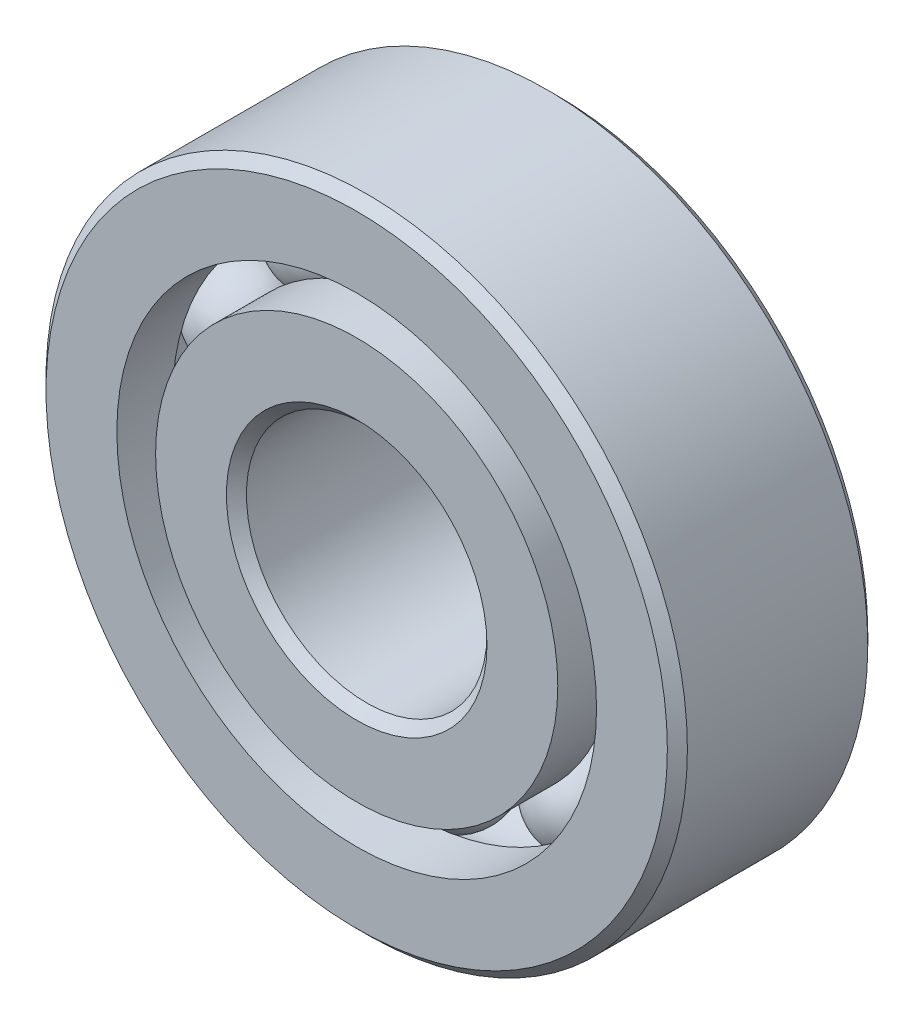
ISO-10303-21;
HEADER;
FILE_DESCRIPTION(('STEP AP214'),'2;1');
FILE_NAME('part.step','',(''),(''),'','','');
FILE_SCHEMA(('AUTOMOTIVE_DESIGN { 1 0 10303 214 1 1 1 1 }'));
ENDSEC;
DATA;
#1=APPLICATION_CONTEXT('core data for automotive mechanical design processes');
#2=APPLICATION_PROTOCOL_DEFINITION('international standard','automotive_design',2000,#1);
#3=PRODUCT_CONTEXT('',#1,'mechanical');
#4=PRODUCT('Part','Part','',(#3));
#5=PRODUCT_RELATED_PRODUCT_CATEGORY('part','',(#4));
#6=PRODUCT_DEFINITION_FORMATION('','',#4);
#7=PRODUCT_DEFINITION_CONTEXT('part definition',#1,'design');
#8=PRODUCT_DEFINITION('design','',#6,#7);
#9=PRODUCT_DEFINITION_SHAPE('','',#8);
#10=(LENGTH_UNIT() NAMED_UNIT(*) SI_UNIT(.MILLI.,.METRE.));
#11=(NAMED_UNIT(*) PLANE_ANGLE_UNIT() SI_UNIT($,.RADIAN.));
#12=(NAMED_UNIT(*) SI_UNIT($,.STERADIAN.) SOLID_ANGLE_UNIT());
#13=UNCERTAINTY_MEASURE_WITH_UNIT(LENGTH_MEASURE(1.E-05),#10,'distance_accuracy_value','');
#14=(GEOMETRIC_REPRESENTATION_CONTEXT(3) GLOBAL_UNCERTAINTY_ASSIGNED_CONTEXT((#13)) GLOBAL_UNIT_ASSIGNED_CONTEXT((#10,
#11,#12)) REPRESENTATION_CONTEXT('',''));
#15=CARTESIAN_POINT('',(0.,0.,0.));
#16=DIRECTION('',(0.,0.,1.));
#17=DIRECTION('',(1.,0.,0.));
#18=AXIS2_PLACEMENT_3D('',#15,#16,#17);
#19=CARTESIAN_POINT('',(-2.56604999203928,3.53186481606816,0.));
#20=DIRECTION('',(0.,0.,1.));
#21=DIRECTION('',(-0.587785252292462,0.809016994374955,0.));
#22=AXIS2_PLACEMENT_3D('',#19,#20,#21);
#23=SPHERICAL_SURFACE('',#22,0.961832467237323);
#24=CARTESIAN_POINT('',(-2.56604999203928,3.53186481606816,0.961832467237321));
#25=VERTEX_POINT('',#24);
#26=VERTEX_LOOP('',#25);
#27=FACE_BOUND('',#26,.T.);
#28=ADVANCED_FACE('F37',(#27),#23,.T.);
#29=CLOSED_SHELL('',(#28));
#30=MANIFOLD_SOLID_BREP('B2',#29);
#31=CARTESIAN_POINT('',(-4.15195610395102,1.34905231606818,0.));
#32=DIRECTION('',(0.,0.,1.));
#33=DIRECTION('',(-0.95105651629515,0.309016994374958,0.));
#34=AXIS2_PLACEMENT_3D('',#31,#32,#33);
#35=SPHERICAL_SURFACE('',#34,0.961832467237323);
#36=CARTESIAN_POINT('',(-4.15195610395102,1.34905231606818,0.961832467237321));
#37=VERTEX_POINT('',#36);
#38=VERTEX_LOOP('',#37);
#39=FACE_BOUND('',#38,.T.);
#40=ADVANCED_FACE('F57',(#39),#35,.T.);
#41=CLOSED_SHELL('',(#40));
#42=MANIFOLD_SOLID_BREP('B6',#41);
#43=CARTESIAN_POINT('',(-4.15195610395104,-1.34905231606809,0.));
#44=DIRECTION('',(0.,0.,1.));
#45=DIRECTION('',(-0.951056516295157,-0.309016994374938,0.));
#46=AXIS2_PLACEMENT_3D('',#43,#44,#45);
#47=SPHERICAL_SURFACE('',#46,0.961832467237323);
#48=CARTESIAN_POINT('',(-4.15195610395104,-1.34905231606809,0.961832467237321));
#49=VERTEX_POINT('',#48);
#50=VERTEX_LOOP('',#49);
#51=FACE_BOUND('',#50,.T.);
#52=ADVANCED_FACE('F77',(#51),#47,.T.);
#53=CLOSED_SHELL('',(#52));
#54=MANIFOLD_SOLID_BREP('B33',#53);
#55=CARTESIAN_POINT('',(-2.56604999203936,-3.53186481606811,0.));
#56=DIRECTION('',(0.,0.,1.));
#57=DIRECTION('',(-0.58778525229248,-0.809016994374942,0.));
#58=AXIS2_PLACEMENT_3D('',#55,#56,#57);
#59=SPHERICAL_SURFACE('',#58,0.961832467237323);
#60=CARTESIAN_POINT('',(-2.56604999203936,-3.53186481606811,0.961832467237321));
#61=VERTEX_POINT('',#60);
#62=VERTEX_LOOP('',#61);
#63=FACE_BOUND('',#62,.T.);
#64=ADVANCED_FACE('F97',(#63),#59,.T.);
#65=CLOSED_SHELL('',(#64));
#66=MANIFOLD_SOLID_BREP('B53',#65);
#67=CARTESIAN_POINT('',(0.,-4.365625,0.));
#68=DIRECTION('',(0.,0.,1.));
#69=DIRECTION('',(0.,-1.,0.));
#70=AXIS2_PLACEMENT_3D('',#67,#68,#69);
#71=SPHERICAL_SURFACE('',#70,0.961832467237323);
#72=CARTESIAN_POINT('',(0.,-4.365625,0.961832467237321));
#73=VERTEX_POINT('',#72);
#74=VERTEX_LOOP('',#73);
#75=FACE_BOUND('',#74,.T.);
#76=ADVANCED_FACE('F117',(#75),#71,.T.);
#77=CLOSED_SHELL('',(#76));
#78=MANIFOLD_SOLID_BREP('B73',#77);
#79=CARTESIAN_POINT('',(2.56604999203931,-3.53186481606815,0.));
#80=DIRECTION('',(0.,0.,1.));
#81=DIRECTION('',(0.587785252292469,-0.809016994374951,0.));
#82=AXIS2_PLACEMENT_3D('',#79,#80,#81);
#83=SPHERICAL_SURFACE('',#82,0.961832467237323);
#84=CARTESIAN_POINT('',(2.56604999203931,-3.53186481606815,0.961832467237321));
#85=VERTEX_POINT('',#84);
#86=VERTEX_LOOP('',#85);
#87=FACE_BOUND('',#86,.T.);
#88=ADVANCED_FACE('F137',(#87),#83,.T.);
#89=CLOSED_SHELL('',(#88));
#90=MANIFOLD_SOLID_BREP('B93',#89);
#91=CARTESIAN_POINT('',(4.15195610395103,-1.34905231606815,0.));
#92=DIRECTION('',(0.,0.,1.));
#93=DIRECTION('',(0.951056516295152,-0.309016994374952,0.));
#94=AXIS2_PLACEMENT_3D('',#91,#92,#93);
#95=SPHERICAL_SURFACE('',#94,0.961832467237323);
#96=CARTESIAN_POINT('',(4.15195610395103,-1.34905231606815,0.961832467237321));
#97=VERTEX_POINT('',#96);
#98=VERTEX_LOOP('',#97);
#99=FACE_BOUND('',#98,.T.);
#100=ADVANCED_FACE('F157',(#99),#95,.T.);
#101=CLOSED_SHELL('',(#100));
#102=MANIFOLD_SOLID_BREP('B113',#101);
#103=CARTESIAN_POINT('',(4.15195610395104,1.34905231606812,0.));
#104=DIRECTION('',(0.,0.,1.));
#105=DIRECTION('',(0.951056516295155,0.309016994374945,0.));
#106=AXIS2_PLACEMENT_3D('',#103,#104,#105);
#107=SPHERICAL_SURFACE('',#106,0.961832467237323);
#108=CARTESIAN_POINT('',(4.15195610395104,1.34905231606812,0.961832467237321));
#109=VERTEX_POINT('',#108);
#110=VERTEX_LOOP('',#109);
#111=FACE_BOUND('',#110,.T.);
#112=ADVANCED_FACE('F177',(#111),#107,.T.);
#113=CLOSED_SHELL('',(#112));
#114=MANIFOLD_SOLID_BREP('B133',#113);
#115=CARTESIAN_POINT('',(2.56604999203933,3.53186481606813,0.));
#116=DIRECTION('',(0.,0.,1.));
#117=DIRECTION('',(0.587785252292474,0.809016994374947,0.));
#118=AXIS2_PLACEMENT_3D('',#115,#116,#117);
#119=SPHERICAL_SURFACE('',#118,0.961832467237323);
#120=CARTESIAN_POINT('',(2.56604999203933,3.53186481606813,0.961832467237321));
#121=VERTEX_POINT('',#120);
#122=VERTEX_LOOP('',#121);
#123=FACE_BOUND('',#122,.T.);
#124=ADVANCED_FACE('F197',(#123),#119,.T.);
#125=CLOSED_SHELL('',(#124));
#126=MANIFOLD_SOLID_BREP('B153',#125);
#127=CARTESIAN_POINT('',(0.,4.365625,0.));
#128=DIRECTION('',(0.,0.,1.));
#129=DIRECTION('',(0.,1.,0.));
#130=AXIS2_PLACEMENT_3D('',#127,#128,#129);
#131=SPHERICAL_SURFACE('',#130,0.961832467237323);
#132=CARTESIAN_POINT('',(0.,4.365625,0.961832467237321));
#133=VERTEX_POINT('',#132);
#134=VERTEX_LOOP('',#133);
#135=FACE_BOUND('',#134,.T.);
#136=ADVANCED_FACE('F219',(#135),#131,.T.);
#137=CLOSED_SHELL('',(#136));
#138=MANIFOLD_SOLID_BREP('B173',#137);
#139=CARTESIAN_POINT('',(0.,3.98183379120879,1.984375));
#140=DIRECTION('',(0.,0.,-1.));
#141=DIRECTION('',(-1.,0.,0.));
#142=AXIS2_PLACEMENT_3D('',#139,#140,#141);
#143=PLANE('',#142);
#144=CARTESIAN_POINT('',(0.,0.,1.984375));
#145=DIRECTION('',(0.,0.,1.));
#146=DIRECTION('',(1.,0.,0.));
#147=AXIS2_PLACEMENT_3D('',#144,#145,#146);
#148=CIRCLE('',#147,2.5796875);
#149=CARTESIAN_POINT('',(2.5796875,0.,1.984375));
#150=VERTEX_POINT('',#149);
#151=EDGE_CURVE('E266',#150,#150,#148,.T.);
#152=ORIENTED_EDGE('',*,*,#151,.F.);
#153=EDGE_LOOP('',(#152));
#154=FACE_BOUND('',#153,.T.);
#155=CARTESIAN_POINT('',(0.,0.,1.984375));
#156=DIRECTION('',(0.,0.,1.));
#157=DIRECTION('',(1.,0.,0.));
#158=AXIS2_PLACEMENT_3D('',#155,#156,#157);
#159=CIRCLE('',#158,3.98183379120879);
#160=CARTESIAN_POINT('',(3.98183379120879,0.,1.984375));
#161=VERTEX_POINT('',#160);
#162=EDGE_CURVE('E218',#161,#161,#159,.T.);
#163=ORIENTED_EDGE('',*,*,#162,.T.);
#164=EDGE_LOOP('',(#163));
#165=FACE_BOUND('',#164,.T.);
#166=ADVANCED_FACE('F238',(#154,#165),#143,.F.);
#167=CARTESIAN_POINT('',(0.,0.,1.984375));
#168=DIRECTION('',(0.,0.,1.));
#169=DIRECTION('',(1.,0.,0.));
#170=AXIS2_PLACEMENT_3D('',#167,#168,#169);
#171=CYLINDRICAL_SURFACE('',#170,3.98183379120879);
#172=ORIENTED_EDGE('',*,*,#162,.F.);
#173=EDGE_LOOP('',(#172));
#174=FACE_BOUND('',#173,.T.);
#175=CARTESIAN_POINT('',(0.,0.,0.881944444444442));
#176=DIRECTION('',(0.,0.,1.));
#177=DIRECTION('',(1.,0.,0.));
#178=AXIS2_PLACEMENT_3D('',#175,#176,#177);
#179=CIRCLE('',#178,3.98183379120879);
#180=CARTESIAN_POINT('',(3.98183379120879,0.,0.881944444444442));
#181=VERTEX_POINT('',#180);
#182=EDGE_CURVE('E244',#181,#181,#179,.T.);
#183=ORIENTED_EDGE('',*,*,#182,.T.);
#184=EDGE_LOOP('',(#183));
#185=FACE_BOUND('',#184,.T.);
#186=ADVANCED_FACE('F273',(#174,#185),#171,.T.);
#187=CARTESIAN_POINT('',(0.,0.,0.));
#188=DIRECTION('',(0.,0.,1.));
#189=DIRECTION('',(1.,0.,0.));
#190=AXIS2_PLACEMENT_3D('',#187,#188,#189);
#191=TOROIDAL_SURFACE('',#190,4.365625,0.96183246723732);
#192=ORIENTED_EDGE('',*,*,#182,.F.);
#193=EDGE_LOOP('',(#192));
#194=FACE_BOUND('',#193,.T.);
#195=CARTESIAN_POINT('',(0.,0.,-0.881944444444446));
#196=DIRECTION('',(0.,0.,1.));
#197=DIRECTION('',(1.,0.,0.));
#198=AXIS2_PLACEMENT_3D('',#195,#196,#197);
#199=CIRCLE('',#198,3.98183379120879);
#200=CARTESIAN_POINT('',(3.98183379120879,0.,-0.881944444444446));
#201=VERTEX_POINT('',#200);
#202=EDGE_CURVE('E248',#201,#201,#199,.T.);
#203=ORIENTED_EDGE('',*,*,#202,.T.);
#204=EDGE_LOOP('',(#203));
#205=FACE_BOUND('',#204,.T.);
#206=ADVANCED_FACE('F277',(#194,#205),#191,.F.);
#207=CARTESIAN_POINT('',(0.,0.,1.984375));
#208=DIRECTION('',(0.,0.,1.));
#209=DIRECTION('',(1.,0.,0.));
#210=AXIS2_PLACEMENT_3D('',#207,#208,#209);
#211=CYLINDRICAL_SURFACE('',#210,3.98183379120879);
#212=ORIENTED_EDGE('',*,*,#202,.F.);
#213=EDGE_LOOP('',(#212));
#214=FACE_BOUND('',#213,.T.);
#215=CARTESIAN_POINT('',(0.,0.,-1.984375));
#216=DIRECTION('',(0.,0.,1.));
#217=DIRECTION('',(1.,0.,0.));
#218=AXIS2_PLACEMENT_3D('',#215,#216,#217);
#219=CIRCLE('',#218,3.98183379120879);
#220=CARTESIAN_POINT('',(3.98183379120879,0.,-1.984375));
#221=VERTEX_POINT('',#220);
#222=EDGE_CURVE('E252',#221,#221,#219,.T.);
#223=ORIENTED_EDGE('',*,*,#222,.T.);
#224=EDGE_LOOP('',(#223));
#225=FACE_BOUND('',#224,.T.);
#226=ADVANCED_FACE('F282',(#214,#225),#211,.T.);
#227=CARTESIAN_POINT('',(0.,2.5796875,-1.984375));
#228=DIRECTION('',(0.,0.,1.));
#229=DIRECTION('',(1.,0.,0.));
#230=AXIS2_PLACEMENT_3D('',#227,#228,#229);
#231=PLANE('',#230);
#232=ORIENTED_EDGE('',*,*,#222,.F.);
#233=EDGE_LOOP('',(#232));
#234=FACE_BOUND('',#233,.T.);
#235=CARTESIAN_POINT('',(0.,0.,-1.98437500000001));
#236=DIRECTION('',(0.,0.,1.));
#237=DIRECTION('',(1.,0.,0.));
#238=AXIS2_PLACEMENT_3D('',#235,#236,#237);
#239=CIRCLE('',#238,2.5796875);
#240=CARTESIAN_POINT('',(2.5796875,0.,-1.98437500000001));
#241=VERTEX_POINT('',#240);
#242=EDGE_CURVE('E257',#241,#241,#239,.T.);
#243=ORIENTED_EDGE('',*,*,#242,.T.);
#244=EDGE_LOOP('',(#243));
#245=FACE_BOUND('',#244,.T.);
#246=ADVANCED_FACE('F288',(#234,#245),#231,.F.);
#247=CARTESIAN_POINT('',(0.,0.,-1.78593750000001));
#248=DIRECTION('',(0.,0.,-1.));
#249=DIRECTION('',(-1.,0.,0.));
#250=AXIS2_PLACEMENT_3D('',#247,#248,#249);
#251=CONICAL_SURFACE('',#250,2.38125,0.785398163397448);
#252=ORIENTED_EDGE('',*,*,#242,.F.);
#253=EDGE_LOOP('',(#252));
#254=FACE_BOUND('',#253,.T.);
#255=CARTESIAN_POINT('',(0.,0.,-1.78593750000001));
#256=DIRECTION('',(0.,0.,1.));
#257=DIRECTION('',(1.,0.,0.));
#258=AXIS2_PLACEMENT_3D('',#255,#256,#257);
#259=CIRCLE('',#258,2.38125);
#260=CARTESIAN_POINT('',(2.38125,0.,-1.78593750000001));
#261=VERTEX_POINT('',#260);
#262=EDGE_CURVE('E260',#261,#261,#259,.T.);
#263=ORIENTED_EDGE('',*,*,#262,.T.);
#264=EDGE_LOOP('',(#263));
#265=FACE_BOUND('',#264,.T.);
#266=ADVANCED_FACE('F292',(#254,#265),#251,.F.);
#267=CARTESIAN_POINT('',(0.,0.,1.984375));
#268=DIRECTION('',(0.,0.,1.));
#269=DIRECTION('',(1.,0.,0.));
#270=AXIS2_PLACEMENT_3D('',#267,#268,#269);
#271=CYLINDRICAL_SURFACE('',#270,2.38125);
#272=ORIENTED_EDGE('',*,*,#262,.F.);
#273=EDGE_LOOP('',(#272));
#274=FACE_BOUND('',#273,.T.);
#275=CARTESIAN_POINT('',(0.,0.,1.78593750000001));
#276=DIRECTION('',(0.,0.,1.));
#277=DIRECTION('',(1.,0.,0.));
#278=AXIS2_PLACEMENT_3D('',#275,#276,#277);
#279=CIRCLE('',#278,2.38125);
#280=CARTESIAN_POINT('',(2.38125,0.,1.78593750000001));
#281=VERTEX_POINT('',#280);
#282=EDGE_CURVE('E263',#281,#281,#279,.T.);
#283=ORIENTED_EDGE('',*,*,#282,.T.);
#284=EDGE_LOOP('',(#283));
#285=FACE_BOUND('',#284,.T.);
#286=ADVANCED_FACE('F296',(#274,#285),#271,.F.);
#287=CARTESIAN_POINT('',(0.,0.,1.984375));
#288=DIRECTION('',(0.,0.,1.));
#289=DIRECTION('',(1.,0.,0.));
#290=AXIS2_PLACEMENT_3D('',#287,#288,#289);
#291=CONICAL_SURFACE('',#290,2.5796875,0.785398163397455);
#292=ORIENTED_EDGE('',*,*,#282,.F.);
#293=EDGE_LOOP('',(#292));
#294=FACE_BOUND('',#293,.T.);
#295=ORIENTED_EDGE('',*,*,#151,.T.);
#296=EDGE_LOOP('',(#295));
#297=FACE_BOUND('',#296,.T.);
#298=ADVANCED_FACE('F270',(#294,#297),#291,.F.);
#299=CLOSED_SHELL('',(#166,#186,#206,#226,#246,#266,#286,#298));
#300=MANIFOLD_SOLID_BREP('B193',#299);
#301=CARTESIAN_POINT('',(0.,0.,1.7859375));
#302=DIRECTION('',(0.,0.,-1.));
#303=DIRECTION('',(-1.,0.,0.));
#304=AXIS2_PLACEMENT_3D('',#301,#302,#303);
#305=CONICAL_SURFACE('',#304,6.35,0.785398163397446);
#306=CARTESIAN_POINT('',(0.,0.,1.984375));
#307=DIRECTION('',(0.,0.,1.));
#308=DIRECTION('',(1.,0.,0.));
#309=AXIS2_PLACEMENT_3D('',#306,#307,#308);
#310=CIRCLE('',#309,6.1515625);
#311=CARTESIAN_POINT('',(6.1515625,0.,1.984375));
#312=VERTEX_POINT('',#311);
#313=EDGE_CURVE('E387',#312,#312,#310,.T.);
#314=ORIENTED_EDGE('',*,*,#313,.F.);
#315=EDGE_LOOP('',(#314));
#316=FACE_BOUND('',#315,.T.);
#317=CARTESIAN_POINT('',(0.,0.,1.7859375));
#318=DIRECTION('',(0.,0.,1.));
#319=DIRECTION('',(1.,0.,0.));
#320=AXIS2_PLACEMENT_3D('',#317,#318,#319);
#321=CIRCLE('',#320,6.35);
#322=CARTESIAN_POINT('',(6.35,0.,1.7859375));
#323=VERTEX_POINT('',#322);
#324=EDGE_CURVE('E237',#323,#323,#321,.T.);
#325=ORIENTED_EDGE('',*,*,#324,.T.);
#326=EDGE_LOOP('',(#325));
#327=FACE_BOUND('',#326,.T.);
#328=ADVANCED_FACE('F359',(#316,#327),#305,.T.);
#329=CARTESIAN_POINT('',(0.,0.,1.984375));
#330=DIRECTION('',(0.,0.,1.));
#331=DIRECTION('',(1.,0.,0.));
#332=AXIS2_PLACEMENT_3D('',#329,#330,#331);
#333=CYLINDRICAL_SURFACE('',#332,6.35);
#334=ORIENTED_EDGE('',*,*,#324,.F.);
#335=EDGE_LOOP('',(#334));
#336=FACE_BOUND('',#335,.T.);
#337=CARTESIAN_POINT('',(0.,0.,-1.78593750000001));
#338=DIRECTION('',(0.,0.,1.));
#339=DIRECTION('',(1.,0.,0.));
#340=AXIS2_PLACEMENT_3D('',#337,#338,#339);
#341=CIRCLE('',#340,6.35);
#342=CARTESIAN_POINT('',(6.35,0.,-1.78593750000001));
#343=VERTEX_POINT('',#342);
#344=EDGE_CURVE('E365',#343,#343,#341,.T.);
#345=ORIENTED_EDGE('',*,*,#344,.T.);
#346=EDGE_LOOP('',(#345));
#347=FACE_BOUND('',#346,.T.);
#348=ADVANCED_FACE('F394',(#336,#347),#333,.T.);
#349=CARTESIAN_POINT('',(0.,0.,-1.98437500000001));
#350=DIRECTION('',(0.,0.,1.));
#351=DIRECTION('',(1.,0.,0.));
#352=AXIS2_PLACEMENT_3D('',#349,#350,#351);
#353=CONICAL_SURFACE('',#352,6.1515625,0.785398163397448);
#354=ORIENTED_EDGE('',*,*,#344,.F.);
#355=EDGE_LOOP('',(#354));
#356=FACE_BOUND('',#355,.T.);
#357=CARTESIAN_POINT('',(0.,0.,-1.98437500000001));
#358=DIRECTION('',(0.,0.,1.));
#359=DIRECTION('',(1.,0.,0.));
#360=AXIS2_PLACEMENT_3D('',#357,#358,#359);
#361=CIRCLE('',#360,6.1515625);
#362=CARTESIAN_POINT('',(6.1515625,0.,-1.98437500000001));
#363=VERTEX_POINT('',#362);
#364=EDGE_CURVE('E369',#363,#363,#361,.T.);
#365=ORIENTED_EDGE('',*,*,#364,.T.);
#366=EDGE_LOOP('',(#365));
#367=FACE_BOUND('',#366,.T.);
#368=ADVANCED_FACE('F398',(#356,#367),#353,.T.);
#369=CARTESIAN_POINT('',(0.,6.1515625,-1.98437500000001));
#370=DIRECTION('',(0.,0.,1.));
#371=DIRECTION('',(1.,0.,0.));
#372=AXIS2_PLACEMENT_3D('',#369,#370,#371);
#373=PLANE('',#372);
#374=ORIENTED_EDGE('',*,*,#364,.F.);
#375=EDGE_LOOP('',(#374));
#376=FACE_BOUND('',#375,.T.);
#377=CARTESIAN_POINT('',(0.,0.,-1.98437500000001));
#378=DIRECTION('',(0.,0.,1.));
#379=DIRECTION('',(1.,0.,0.));
#380=AXIS2_PLACEMENT_3D('',#377,#378,#379);
#381=CIRCLE('',#380,4.74941620879121);
#382=CARTESIAN_POINT('',(4.74941620879121,0.,-1.98437500000001));
#383=VERTEX_POINT('',#382);
#384=EDGE_CURVE('E373',#383,#383,#381,.T.);
#385=ORIENTED_EDGE('',*,*,#384,.T.);
#386=EDGE_LOOP('',(#385));
#387=FACE_BOUND('',#386,.T.);
#388=ADVANCED_FACE('F403',(#376,#387),#373,.F.);
#389=CARTESIAN_POINT('',(0.,0.,1.984375));
#390=DIRECTION('',(0.,0.,1.));
#391=DIRECTION('',(1.,0.,0.));
#392=AXIS2_PLACEMENT_3D('',#389,#390,#391);
#393=CYLINDRICAL_SURFACE('',#392,4.74941620879121);
#394=ORIENTED_EDGE('',*,*,#384,.F.);
#395=EDGE_LOOP('',(#394));
#396=FACE_BOUND('',#395,.T.);
#397=CARTESIAN_POINT('',(0.,0.,-0.881944444444447));
#398=DIRECTION('',(0.,0.,1.));
#399=DIRECTION('',(1.,0.,0.));
#400=AXIS2_PLACEMENT_3D('',#397,#398,#399);
#401=CIRCLE('',#400,4.74941620879121);
#402=CARTESIAN_POINT('',(4.74941620879121,0.,-0.881944444444447));
#403=VERTEX_POINT('',#402);
#404=EDGE_CURVE('E378',#403,#403,#401,.T.);
#405=ORIENTED_EDGE('',*,*,#404,.T.);
#406=EDGE_LOOP('',(#405));
#407=FACE_BOUND('',#406,.T.);
#408=ADVANCED_FACE('F409',(#396,#407),#393,.F.);
#409=CARTESIAN_POINT('',(0.,0.,0.));
#410=DIRECTION('',(0.,0.,1.));
#411=DIRECTION('',(1.,0.,0.));
#412=AXIS2_PLACEMENT_3D('',#409,#410,#411);
#413=TOROIDAL_SURFACE('',#412,4.365625,0.961832467237323);
#414=ORIENTED_EDGE('',*,*,#404,.F.);
#415=EDGE_LOOP('',(#414));
#416=FACE_BOUND('',#415,.T.);
#417=CARTESIAN_POINT('',(0.,0.,0.881944444444442));
#418=DIRECTION('',(0.,0.,1.));
#419=DIRECTION('',(1.,0.,0.));
#420=AXIS2_PLACEMENT_3D('',#417,#418,#419);
#421=CIRCLE('',#420,4.74941620879121);
#422=CARTESIAN_POINT('',(4.74941620879121,0.,0.881944444444442));
#423=VERTEX_POINT('',#422);
#424=EDGE_CURVE('E381',#423,#423,#421,.T.);
#425=ORIENTED_EDGE('',*,*,#424,.T.);
#426=EDGE_LOOP('',(#425));
#427=FACE_BOUND('',#426,.T.);
#428=ADVANCED_FACE('F413',(#416,#427),#413,.F.);
#429=CARTESIAN_POINT('',(0.,0.,1.984375));
#430=DIRECTION('',(0.,0.,1.));
#431=DIRECTION('',(1.,0.,0.));
#432=AXIS2_PLACEMENT_3D('',#429,#430,#431);
#433=CYLINDRICAL_SURFACE('',#432,4.74941620879121);
#434=ORIENTED_EDGE('',*,*,#424,.F.);
#435=EDGE_LOOP('',(#434));
#436=FACE_BOUND('',#435,.T.);
#437=CARTESIAN_POINT('',(0.,0.,1.984375));
#438=DIRECTION('',(0.,0.,1.));
#439=DIRECTION('',(1.,0.,0.));
#440=AXIS2_PLACEMENT_3D('',#437,#438,#439);
#441=CIRCLE('',#440,4.74941620879121);
#442=CARTESIAN_POINT('',(4.74941620879121,0.,1.984375));
#443=VERTEX_POINT('',#442);
#444=EDGE_CURVE('E384',#443,#443,#441,.T.);
#445=ORIENTED_EDGE('',*,*,#444,.T.);
#446=EDGE_LOOP('',(#445));
#447=FACE_BOUND('',#446,.T.);
#448=ADVANCED_FACE('F417',(#436,#447),#433,.F.);
#449=CARTESIAN_POINT('',(0.,6.1515625,1.984375));
#450=DIRECTION('',(0.,0.,-1.));
#451=DIRECTION('',(-1.,0.,0.));
#452=AXIS2_PLACEMENT_3D('',#449,#450,#451);
#453=PLANE('',#452);
#454=ORIENTED_EDGE('',*,*,#444,.F.);
#455=EDGE_LOOP('',(#454));
#456=FACE_BOUND('',#455,.T.);
#457=ORIENTED_EDGE('',*,*,#313,.T.);
#458=EDGE_LOOP('',(#457));
#459=FACE_BOUND('',#458,.T.);
#460=ADVANCED_FACE('F391',(#456,#459),#453,.F.);
#461=CLOSED_SHELL('',(#328,#348,#368,#388,#408,#428,#448,#460));
#462=MANIFOLD_SOLID_BREP('B213',#461);
#463=ADVANCED_BREP_SHAPE_REPRESENTATION('',(#18,#30,#42,#54,#66,#78,#90,#102,#114,#126,#138,
#300,#462),#14);
#464=SHAPE_DEFINITION_REPRESENTATION(#9,#463);
ENDSEC;
END-ISO-10303-21;
